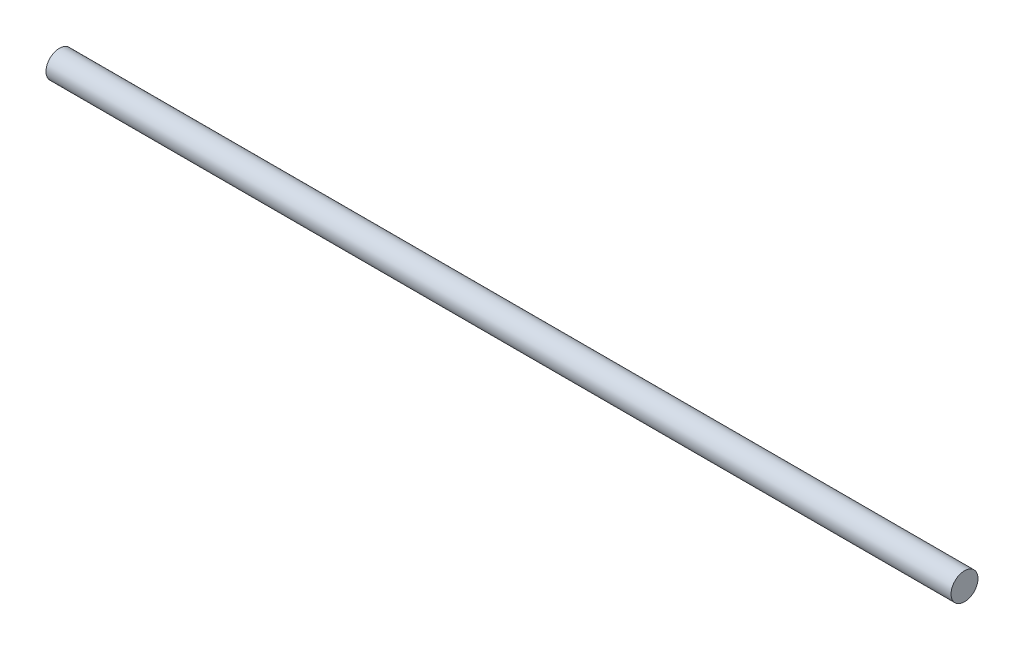
ISO-10303-21;
HEADER;
FILE_DESCRIPTION(('STEP AP214'),'2;1');
FILE_NAME('part.step','',(''),(''),'','','');
FILE_SCHEMA(('AUTOMOTIVE_DESIGN { 1 0 10303 214 1 1 1 1 }'));
ENDSEC;
DATA;
#1=APPLICATION_CONTEXT('core data for automotive mechanical design processes');
#2=APPLICATION_PROTOCOL_DEFINITION('international standard','automotive_design',2000,#1);
#3=PRODUCT_CONTEXT('',#1,'mechanical');
#4=PRODUCT('Part','Part','',(#3));
#5=PRODUCT_RELATED_PRODUCT_CATEGORY('part','',(#4));
#6=PRODUCT_DEFINITION_FORMATION('','',#4);
#7=PRODUCT_DEFINITION_CONTEXT('part definition',#1,'design');
#8=PRODUCT_DEFINITION('design','',#6,#7);
#9=PRODUCT_DEFINITION_SHAPE('','',#8);
#10=(LENGTH_UNIT() NAMED_UNIT(*) SI_UNIT(.MILLI.,.METRE.));
#11=(NAMED_UNIT(*) PLANE_ANGLE_UNIT() SI_UNIT($,.RADIAN.));
#12=(NAMED_UNIT(*) SI_UNIT($,.STERADIAN.) SOLID_ANGLE_UNIT());
#13=UNCERTAINTY_MEASURE_WITH_UNIT(LENGTH_MEASURE(1.E-05),#10,'distance_accuracy_value','');
#14=(GEOMETRIC_REPRESENTATION_CONTEXT(3) GLOBAL_UNCERTAINTY_ASSIGNED_CONTEXT((#13)) GLOBAL_UNIT_ASSIGNED_CONTEXT((#10,
#11,#12)) REPRESENTATION_CONTEXT('',''));
#15=CARTESIAN_POINT('',(0.,0.,0.));
#16=DIRECTION('',(0.,0.,1.));
#17=DIRECTION('',(1.,0.,0.));
#18=AXIS2_PLACEMENT_3D('',#15,#16,#17);
#19=CARTESIAN_POINT('',(320.,0.,0.));
#20=DIRECTION('',(-1.,0.,0.));
#21=DIRECTION('',(0.,0.,1.));
#22=AXIS2_PLACEMENT_3D('',#19,#20,#21);
#23=CYLINDRICAL_SURFACE('',#22,4.765);
#24=CARTESIAN_POINT('',(320.,0.,0.));
#25=DIRECTION('',(1.,0.,0.));
#26=DIRECTION('',(0.,0.,-1.));
#27=AXIS2_PLACEMENT_3D('',#24,#25,#26);
#28=CIRCLE('',#27,4.765);
#29=CARTESIAN_POINT('',(320.,0.,-4.765));
#30=VERTEX_POINT('',#29);
#31=EDGE_CURVE('E10',#30,#30,#28,.T.);
#32=ORIENTED_EDGE('',*,*,#31,.F.);
#33=EDGE_LOOP('',(#32));
#34=FACE_BOUND('',#33,.T.);
#35=CARTESIAN_POINT('',(0.,0.,0.));
#36=DIRECTION('',(1.,0.,0.));
#37=DIRECTION('',(0.,0.,-1.));
#38=AXIS2_PLACEMENT_3D('',#35,#36,#37);
#39=CIRCLE('',#38,4.765);
#40=CARTESIAN_POINT('',(0.,0.,-4.765));
#41=VERTEX_POINT('',#40);
#42=EDGE_CURVE('E38',#41,#41,#39,.T.);
#43=ORIENTED_EDGE('',*,*,#42,.T.);
#44=EDGE_LOOP('',(#43));
#45=FACE_BOUND('',#44,.T.);
#46=ADVANCED_FACE('F35',(#34,#45),#23,.T.);
#47=CARTESIAN_POINT('',(320.,0.,0.));
#48=DIRECTION('',(1.,0.,0.));
#49=DIRECTION('',(0.,0.,-1.));
#50=AXIS2_PLACEMENT_3D('',#47,#48,#49);
#51=PLANE('',#50);
#52=ORIENTED_EDGE('',*,*,#31,.T.);
#53=EDGE_LOOP('',(#52));
#54=FACE_BOUND('',#53,.T.);
#55=ADVANCED_FACE('F50',(#54),#51,.T.);
#56=CARTESIAN_POINT('',(0.,0.,0.));
#57=DIRECTION('',(1.,0.,0.));
#58=DIRECTION('',(0.,0.,-1.));
#59=AXIS2_PLACEMENT_3D('',#56,#57,#58);
#60=PLANE('',#59);
#61=ORIENTED_EDGE('',*,*,#42,.F.);
#62=EDGE_LOOP('',(#61));
#63=FACE_BOUND('',#62,.T.);
#64=ADVANCED_FACE('F48',(#63),#60,.F.);
#65=CLOSED_SHELL('',(#46,#55,#64));
#66=MANIFOLD_SOLID_BREP('B2',#65);
#67=ADVANCED_BREP_SHAPE_REPRESENTATION('',(#18,#66),#14);
#68=SHAPE_DEFINITION_REPRESENTATION(#9,#67);
ENDSEC;
END-ISO-10303-21;
